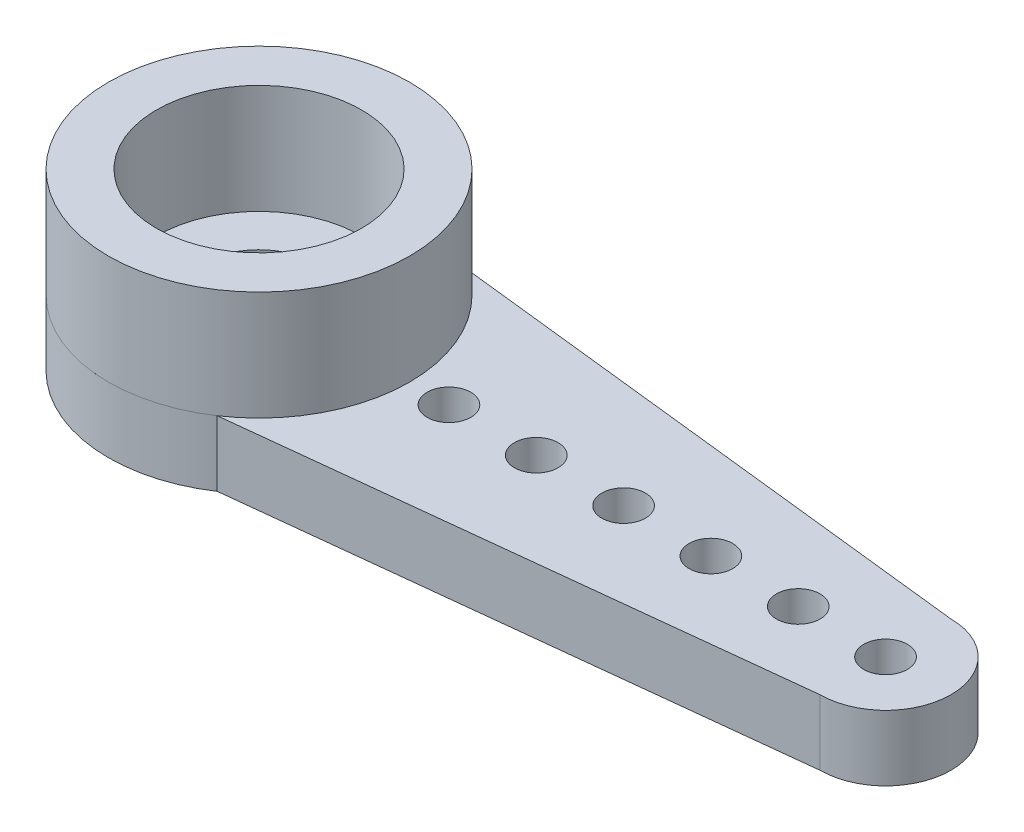
ISO-10303-21;
HEADER;
FILE_DESCRIPTION(('STEP AP214'),'2;1');
FILE_NAME('part.step','',(''),(''),'','','');
FILE_SCHEMA(('AUTOMOTIVE_DESIGN { 1 0 10303 214 1 1 1 1 }'));
ENDSEC;
DATA;
#1=APPLICATION_CONTEXT('core data for automotive mechanical design processes');
#2=APPLICATION_PROTOCOL_DEFINITION('international standard','automotive_design',2000,#1);
#3=PRODUCT_CONTEXT('',#1,'mechanical');
#4=PRODUCT('Part','Part','',(#3));
#5=PRODUCT_RELATED_PRODUCT_CATEGORY('part','',(#4));
#6=PRODUCT_DEFINITION_FORMATION('','',#4);
#7=PRODUCT_DEFINITION_CONTEXT('part definition',#1,'design');
#8=PRODUCT_DEFINITION('design','',#6,#7);
#9=PRODUCT_DEFINITION_SHAPE('','',#8);
#10=(LENGTH_UNIT() NAMED_UNIT(*) SI_UNIT(.MILLI.,.METRE.));
#11=(NAMED_UNIT(*) PLANE_ANGLE_UNIT() SI_UNIT($,.RADIAN.));
#12=(NAMED_UNIT(*) SI_UNIT($,.STERADIAN.) SOLID_ANGLE_UNIT());
#13=UNCERTAINTY_MEASURE_WITH_UNIT(LENGTH_MEASURE(1.E-05),#10,'distance_accuracy_value','');
#14=(GEOMETRIC_REPRESENTATION_CONTEXT(3) GLOBAL_UNCERTAINTY_ASSIGNED_CONTEXT((#13)) GLOBAL_UNIT_ASSIGNED_CONTEXT((#10,
#11,#12)) REPRESENTATION_CONTEXT('',''));
#15=CARTESIAN_POINT('',(0.,0.,0.));
#16=DIRECTION('',(0.,0.,1.));
#17=DIRECTION('',(1.,0.,0.));
#18=AXIS2_PLACEMENT_3D('',#15,#16,#17);
#19=CARTESIAN_POINT('',(0.,4.,0.));
#20=DIRECTION('',(0.,-1.,0.));
#21=DIRECTION('',(0.,0.,-1.));
#22=AXIS2_PLACEMENT_3D('',#19,#20,#21);
#23=CYLINDRICAL_SURFACE('',#22,2.35);
#24=CARTESIAN_POINT('',(0.,4.,0.));
#25=DIRECTION('',(0.,1.,0.));
#26=DIRECTION('',(0.,0.,1.));
#27=AXIS2_PLACEMENT_3D('',#24,#25,#26);
#28=CIRCLE('',#27,2.35);
#29=CARTESIAN_POINT('',(0.,4.,2.35));
#30=VERTEX_POINT('',#29);
#31=EDGE_CURVE('E48',#30,#30,#28,.T.);
#32=ORIENTED_EDGE('',*,*,#31,.T.);
#33=EDGE_LOOP('',(#32));
#34=FACE_BOUND('',#33,.T.);
#35=CARTESIAN_POINT('',(0.,1.5,0.));
#36=DIRECTION('',(0.,1.,0.));
#37=DIRECTION('',(0.,0.,1.));
#38=AXIS2_PLACEMENT_3D('',#35,#36,#37);
#39=CIRCLE('',#38,2.35);
#40=CARTESIAN_POINT('',(0.,1.5,2.35));
#41=VERTEX_POINT('',#40);
#42=EDGE_CURVE('E54',#41,#41,#39,.T.);
#43=ORIENTED_EDGE('',*,*,#42,.F.);
#44=EDGE_LOOP('',(#43));
#45=FACE_BOUND('',#44,.T.);
#46=ADVANCED_FACE('F41',(#34,#45),#23,.F.);
#47=CARTESIAN_POINT('',(0.,4.,0.));
#48=DIRECTION('',(0.,-1.,0.));
#49=DIRECTION('',(0.,0.,-1.));
#50=AXIS2_PLACEMENT_3D('',#47,#48,#49);
#51=CYLINDRICAL_SURFACE('',#50,3.45);
#52=CARTESIAN_POINT('',(0.,4.,0.));
#53=DIRECTION('',(0.,1.,0.));
#54=DIRECTION('',(0.,0.,1.));
#55=AXIS2_PLACEMENT_3D('',#52,#53,#54);
#56=CIRCLE('',#55,3.45);
#57=CARTESIAN_POINT('',(0.,4.,3.45));
#58=VERTEX_POINT('',#57);
#59=EDGE_CURVE('E11',#58,#58,#56,.T.);
#60=ORIENTED_EDGE('',*,*,#59,.F.);
#61=EDGE_LOOP('',(#60));
#62=FACE_BOUND('',#61,.T.);
#63=CARTESIAN_POINT('',(0.,1.5,0.));
#64=DIRECTION('',(0.,1.,0.));
#65=DIRECTION('',(0.,0.,1.));
#66=AXIS2_PLACEMENT_3D('',#63,#64,#65);
#67=CIRCLE('',#66,3.45);
#68=CARTESIAN_POINT('',(0.,1.5,3.45));
#69=VERTEX_POINT('',#68);
#70=EDGE_CURVE('E44',#69,#69,#67,.T.);
#71=ORIENTED_EDGE('',*,*,#70,.T.);
#72=EDGE_LOOP('',(#71));
#73=FACE_BOUND('',#72,.T.);
#74=ADVANCED_FACE('F61',(#62,#73),#51,.T.);
#75=CARTESIAN_POINT('',(0.,4.,0.));
#76=DIRECTION('',(0.,1.,0.));
#77=DIRECTION('',(0.,0.,1.));
#78=AXIS2_PLACEMENT_3D('',#75,#76,#77);
#79=PLANE('',#78);
#80=ORIENTED_EDGE('',*,*,#31,.F.);
#81=EDGE_LOOP('',(#80));
#82=FACE_BOUND('',#81,.T.);
#83=ORIENTED_EDGE('',*,*,#59,.T.);
#84=EDGE_LOOP('',(#83));
#85=FACE_BOUND('',#84,.T.);
#86=ADVANCED_FACE('F65',(#82,#85),#79,.T.);
#87=CARTESIAN_POINT('',(0.,1.5,0.));
#88=DIRECTION('',(0.,1.,0.));
#89=DIRECTION('',(0.,0.,1.));
#90=AXIS2_PLACEMENT_3D('',#87,#88,#89);
#91=PLANE('',#90);
#92=ORIENTED_EDGE('',*,*,#42,.T.);
#93=EDGE_LOOP('',(#92));
#94=FACE_BOUND('',#93,.T.);
#95=ORIENTED_EDGE('',*,*,#70,.F.);
#96=EDGE_LOOP('',(#95));
#97=FACE_BOUND('',#96,.T.);
#98=ADVANCED_FACE('F63',(#94,#97),#91,.F.);
#99=CLOSED_SHELL('',(#46,#74,#86,#98));
#100=MANIFOLD_SOLID_BREP('B2',#99);
#101=CARTESIAN_POINT('',(0.,1.,0.));
#102=DIRECTION('',(0.,1.,0.));
#103=DIRECTION('',(0.,0.,1.));
#104=AXIS2_PLACEMENT_3D('',#101,#102,#103);
#105=CYLINDRICAL_SURFACE('',#104,1.275);
#106=CARTESIAN_POINT('',(0.,1.,0.));
#107=DIRECTION('',(0.,1.,0.));
#108=DIRECTION('',(0.,0.,1.));
#109=AXIS2_PLACEMENT_3D('',#106,#107,#108);
#110=CIRCLE('',#109,1.275);
#111=CARTESIAN_POINT('',(0.,1.,1.275));
#112=VERTEX_POINT('',#111);
#113=EDGE_CURVE('E118',#112,#112,#110,.T.);
#114=ORIENTED_EDGE('',*,*,#113,.F.);
#115=EDGE_LOOP('',(#114));
#116=FACE_BOUND('',#115,.T.);
#117=CARTESIAN_POINT('',(0.,1.5,0.));
#118=DIRECTION('',(0.,1.,0.));
#119=DIRECTION('',(0.,0.,1.));
#120=AXIS2_PLACEMENT_3D('',#117,#118,#119);
#121=CIRCLE('',#120,1.275);
#122=CARTESIAN_POINT('',(0.,1.5,1.275));
#123=VERTEX_POINT('',#122);
#124=EDGE_CURVE('E124',#123,#123,#121,.T.);
#125=ORIENTED_EDGE('',*,*,#124,.T.);
#126=EDGE_LOOP('',(#125));
#127=FACE_BOUND('',#126,.T.);
#128=ADVANCED_FACE('F111',(#116,#127),#105,.F.);
#129=CARTESIAN_POINT('',(0.,1.,0.));
#130=DIRECTION('',(0.,1.,0.));
#131=DIRECTION('',(0.,0.,1.));
#132=AXIS2_PLACEMENT_3D('',#129,#130,#131);
#133=CYLINDRICAL_SURFACE('',#132,2.35);
#134=CARTESIAN_POINT('',(0.,1.,0.));
#135=DIRECTION('',(0.,1.,0.));
#136=DIRECTION('',(0.,0.,1.));
#137=AXIS2_PLACEMENT_3D('',#134,#135,#136);
#138=CIRCLE('',#137,2.35);
#139=CARTESIAN_POINT('',(0.,1.,2.35));
#140=VERTEX_POINT('',#139);
#141=EDGE_CURVE('E40',#140,#140,#138,.T.);
#142=ORIENTED_EDGE('',*,*,#141,.T.);
#143=EDGE_LOOP('',(#142));
#144=FACE_BOUND('',#143,.T.);
#145=CARTESIAN_POINT('',(0.,1.5,0.));
#146=DIRECTION('',(0.,1.,0.));
#147=DIRECTION('',(0.,0.,1.));
#148=AXIS2_PLACEMENT_3D('',#145,#146,#147);
#149=CIRCLE('',#148,2.35);
#150=CARTESIAN_POINT('',(0.,1.5,2.35));
#151=VERTEX_POINT('',#150);
#152=EDGE_CURVE('E114',#151,#151,#149,.T.);
#153=ORIENTED_EDGE('',*,*,#152,.F.);
#154=EDGE_LOOP('',(#153));
#155=FACE_BOUND('',#154,.T.);
#156=ADVANCED_FACE('F133',(#144,#155),#133,.T.);
#157=CARTESIAN_POINT('',(0.,1.,0.));
#158=DIRECTION('',(0.,1.,0.));
#159=DIRECTION('',(0.,0.,1.));
#160=AXIS2_PLACEMENT_3D('',#157,#158,#159);
#161=PLANE('',#160);
#162=ORIENTED_EDGE('',*,*,#113,.T.);
#163=EDGE_LOOP('',(#162));
#164=FACE_BOUND('',#163,.T.);
#165=ORIENTED_EDGE('',*,*,#141,.F.);
#166=EDGE_LOOP('',(#165));
#167=FACE_BOUND('',#166,.T.);
#168=ADVANCED_FACE('F135',(#164,#167),#161,.F.);
#169=CARTESIAN_POINT('',(0.,1.5,0.));
#170=DIRECTION('',(0.,1.,0.));
#171=DIRECTION('',(0.,0.,1.));
#172=AXIS2_PLACEMENT_3D('',#169,#170,#171);
#173=PLANE('',#172);
#174=ORIENTED_EDGE('',*,*,#124,.F.);
#175=EDGE_LOOP('',(#174));
#176=FACE_BOUND('',#175,.T.);
#177=ORIENTED_EDGE('',*,*,#152,.T.);
#178=EDGE_LOOP('',(#177));
#179=FACE_BOUND('',#178,.T.);
#180=ADVANCED_FACE('F131',(#176,#179),#173,.T.);
#181=CLOSED_SHELL('',(#128,#156,#168,#180));
#182=MANIFOLD_SOLID_BREP('B6',#181);
#183=CARTESIAN_POINT('',(14.35,1.5,0.));
#184=DIRECTION('',(0.,1.,0.));
#185=DIRECTION('',(0.,0.,1.));
#186=AXIS2_PLACEMENT_3D('',#183,#184,#185);
#187=PLANE('',#186);
#188=CARTESIAN_POINT('',(6.35,1.5,0.));
#189=DIRECTION('',(0.,1.,0.));
#190=DIRECTION('',(0.,0.,1.));
#191=AXIS2_PLACEMENT_3D('',#188,#189,#190);
#192=CIRCLE('',#191,0.5);
#193=CARTESIAN_POINT('',(6.35,1.5,0.5));
#194=VERTEX_POINT('',#193);
#195=EDGE_CURVE('E278',#194,#194,#192,.T.);
#196=ORIENTED_EDGE('',*,*,#195,.F.);
#197=EDGE_LOOP('',(#196));
#198=FACE_BOUND('',#197,.T.);
#199=CARTESIAN_POINT('',(8.35,1.5,0.));
#200=DIRECTION('',(0.,1.,0.));
#201=DIRECTION('',(0.,0.,1.));
#202=AXIS2_PLACEMENT_3D('',#199,#200,#201);
#203=CIRCLE('',#202,0.500000000000001);
#204=CARTESIAN_POINT('',(8.35,1.5,0.500000000000001));
#205=VERTEX_POINT('',#204);
#206=EDGE_CURVE('E266',#205,#205,#203,.T.);
#207=ORIENTED_EDGE('',*,*,#206,.F.);
#208=EDGE_LOOP('',(#207));
#209=FACE_BOUND('',#208,.T.);
#210=CARTESIAN_POINT('',(12.35,1.5,0.));
#211=DIRECTION('',(0.,1.,0.));
#212=DIRECTION('',(0.,0.,1.));
#213=AXIS2_PLACEMENT_3D('',#210,#211,#212);
#214=CIRCLE('',#213,0.500000000000001);
#215=CARTESIAN_POINT('',(12.35,1.5,0.500000000000001));
#216=VERTEX_POINT('',#215);
#217=EDGE_CURVE('E254',#216,#216,#214,.T.);
#218=ORIENTED_EDGE('',*,*,#217,.F.);
#219=EDGE_LOOP('',(#218));
#220=FACE_BOUND('',#219,.T.);
#221=CARTESIAN_POINT('',(14.35,1.5,0.));
#222=DIRECTION('',(0.,1.,0.));
#223=DIRECTION('',(0.,0.,1.));
#224=AXIS2_PLACEMENT_3D('',#221,#222,#223);
#225=CIRCLE('',#224,1.5);
#226=CARTESIAN_POINT('',(14.35,1.5,1.5));
#227=VERTEX_POINT('',#226);
#228=CARTESIAN_POINT('',(14.35,1.5,-1.5));
#229=VERTEX_POINT('',#228);
#230=EDGE_CURVE('E224',#227,#229,#225,.T.);
#231=ORIENTED_EDGE('',*,*,#230,.T.);
#232=DIRECTION('',(-0.993819276776604,0.,-0.111010112634965));
#233=VECTOR('',#232,1.);
#234=CARTESIAN_POINT('',(14.35,1.5,-1.5));
#235=LINE('',#234,#233);
#236=CARTESIAN_POINT('',(1.87974276835085,1.5,-2.89293399939105));
#237=VERTEX_POINT('',#236);
#238=EDGE_CURVE('E219',#229,#237,#235,.T.);
#239=ORIENTED_EDGE('',*,*,#238,.T.);
#240=CARTESIAN_POINT('',(0.,1.5,0.));
#241=DIRECTION('',(0.,1.,0.));
#242=DIRECTION('',(0.,0.,1.));
#243=AXIS2_PLACEMENT_3D('',#240,#241,#242);
#244=CIRCLE('',#243,3.45);
#245=CARTESIAN_POINT('',(1.913197247407,1.5,2.87091906756604));
#246=VERTEX_POINT('',#245);
#247=EDGE_CURVE('E222',#237,#246,#244,.T.);
#248=ORIENTED_EDGE('',*,*,#247,.T.);
#249=DIRECTION('',(0.993979393584622,0.,-0.109567171767582));
#250=VECTOR('',#249,1.);
#251=CARTESIAN_POINT('',(1.913197247407,1.5,2.87091906756604));
#252=LINE('',#251,#250);
#253=EDGE_CURVE('E189',#246,#227,#252,.T.);
#254=ORIENTED_EDGE('',*,*,#253,.T.);
#255=EDGE_LOOP('',(#231,#239,#248,#254));
#256=FACE_BOUND('',#255,.T.);
#257=CARTESIAN_POINT('',(0.,1.5,0.));
#258=DIRECTION('',(0.,1.,0.));
#259=DIRECTION('',(0.,0.,1.));
#260=AXIS2_PLACEMENT_3D('',#257,#258,#259);
#261=CIRCLE('',#260,2.35);
#262=CARTESIAN_POINT('',(0.,1.5,2.35));
#263=VERTEX_POINT('',#262);
#264=EDGE_CURVE('E239',#263,#263,#261,.T.);
#265=ORIENTED_EDGE('',*,*,#264,.F.);
#266=EDGE_LOOP('',(#265));
#267=FACE_BOUND('',#266,.T.);
#268=CARTESIAN_POINT('',(10.35,1.5,0.));
#269=DIRECTION('',(0.,1.,0.));
#270=DIRECTION('',(0.,0.,1.));
#271=AXIS2_PLACEMENT_3D('',#268,#269,#270);
#272=CIRCLE('',#271,0.500000000000001);
#273=CARTESIAN_POINT('',(10.35,1.5,0.500000000000001));
#274=VERTEX_POINT('',#273);
#275=EDGE_CURVE('E260',#274,#274,#272,.T.);
#276=ORIENTED_EDGE('',*,*,#275,.F.);
#277=EDGE_LOOP('',(#276));
#278=FACE_BOUND('',#277,.T.);
#279=CARTESIAN_POINT('',(14.35,1.5,0.));
#280=DIRECTION('',(0.,1.,0.));
#281=DIRECTION('',(0.,0.,1.));
#282=AXIS2_PLACEMENT_3D('',#279,#280,#281);
#283=CIRCLE('',#282,0.499999999999999);
#284=CARTESIAN_POINT('',(14.35,1.5,0.499999999999999));
#285=VERTEX_POINT('',#284);
#286=EDGE_CURVE('E272',#285,#285,#283,.T.);
#287=ORIENTED_EDGE('',*,*,#286,.F.);
#288=EDGE_LOOP('',(#287));
#289=FACE_BOUND('',#288,.T.);
#290=CARTESIAN_POINT('',(4.35,1.5,0.));
#291=DIRECTION('',(0.,1.,0.));
#292=DIRECTION('',(0.,0.,1.));
#293=AXIS2_PLACEMENT_3D('',#290,#291,#292);
#294=CIRCLE('',#293,0.500000000000001);
#295=CARTESIAN_POINT('',(4.35,1.5,0.500000000000001));
#296=VERTEX_POINT('',#295);
#297=EDGE_CURVE('E284',#296,#296,#294,.T.);
#298=ORIENTED_EDGE('',*,*,#297,.F.);
#299=EDGE_LOOP('',(#298));
#300=FACE_BOUND('',#299,.T.);
#301=ADVANCED_FACE('F172',(#198,#209,#220,#256,#267,#278,#289,#300),#187,.T.);
#302=CARTESIAN_POINT('',(14.35,0.,0.));
#303=DIRECTION('',(0.,1.,0.));
#304=DIRECTION('',(0.,0.,1.));
#305=AXIS2_PLACEMENT_3D('',#302,#303,#304);
#306=PLANE('',#305);
#307=CARTESIAN_POINT('',(14.35,0.,0.));
#308=DIRECTION('',(0.,1.,0.));
#309=DIRECTION('',(0.,0.,1.));
#310=AXIS2_PLACEMENT_3D('',#307,#308,#309);
#311=CIRCLE('',#310,1.5);
#312=CARTESIAN_POINT('',(14.35,0.,1.5));
#313=VERTEX_POINT('',#312);
#314=CARTESIAN_POINT('',(14.35,0.,-1.5));
#315=VERTEX_POINT('',#314);
#316=EDGE_CURVE('E236',#313,#315,#311,.T.);
#317=ORIENTED_EDGE('',*,*,#316,.F.);
#318=DIRECTION('',(0.993979393584622,0.,-0.109567171767582));
#319=VECTOR('',#318,1.);
#320=CARTESIAN_POINT('',(1.913197247407,0.,2.87091906756604));
#321=LINE('',#320,#319);
#322=CARTESIAN_POINT('',(1.913197247407,0.,2.87091906756604));
#323=VERTEX_POINT('',#322);
#324=EDGE_CURVE('E212',#323,#313,#321,.T.);
#325=ORIENTED_EDGE('',*,*,#324,.F.);
#326=CARTESIAN_POINT('',(0.,0.,0.));
#327=DIRECTION('',(0.,1.,0.));
#328=DIRECTION('',(0.,0.,1.));
#329=AXIS2_PLACEMENT_3D('',#326,#327,#328);
#330=CIRCLE('',#329,3.45);
#331=CARTESIAN_POINT('',(1.87974276835085,0.,-2.89293399939105));
#332=VERTEX_POINT('',#331);
#333=EDGE_CURVE('E206',#332,#323,#330,.T.);
#334=ORIENTED_EDGE('',*,*,#333,.F.);
#335=DIRECTION('',(-0.993819276776604,0.,-0.111010112634965));
#336=VECTOR('',#335,1.);
#337=CARTESIAN_POINT('',(14.35,0.,-1.5));
#338=LINE('',#337,#336);
#339=EDGE_CURVE('E228',#315,#332,#338,.T.);
#340=ORIENTED_EDGE('',*,*,#339,.F.);
#341=EDGE_LOOP('',(#317,#325,#334,#340));
#342=FACE_BOUND('',#341,.T.);
#343=CARTESIAN_POINT('',(0.,0.,0.));
#344=DIRECTION('',(0.,1.,0.));
#345=DIRECTION('',(0.,0.,1.));
#346=AXIS2_PLACEMENT_3D('',#343,#344,#345);
#347=CIRCLE('',#346,2.35);
#348=CARTESIAN_POINT('',(0.,0.,2.35));
#349=VERTEX_POINT('',#348);
#350=EDGE_CURVE('E251',#349,#349,#347,.T.);
#351=ORIENTED_EDGE('',*,*,#350,.T.);
#352=EDGE_LOOP('',(#351));
#353=FACE_BOUND('',#352,.T.);
#354=CARTESIAN_POINT('',(12.35,0.,0.));
#355=DIRECTION('',(0.,1.,0.));
#356=DIRECTION('',(0.,0.,1.));
#357=AXIS2_PLACEMENT_3D('',#354,#355,#356);
#358=CIRCLE('',#357,0.500000000000001);
#359=CARTESIAN_POINT('',(12.35,0.,0.500000000000001));
#360=VERTEX_POINT('',#359);
#361=EDGE_CURVE('E257',#360,#360,#358,.T.);
#362=ORIENTED_EDGE('',*,*,#361,.T.);
#363=EDGE_LOOP('',(#362));
#364=FACE_BOUND('',#363,.T.);
#365=CARTESIAN_POINT('',(10.35,0.,0.));
#366=DIRECTION('',(0.,1.,0.));
#367=DIRECTION('',(0.,0.,1.));
#368=AXIS2_PLACEMENT_3D('',#365,#366,#367);
#369=CIRCLE('',#368,0.500000000000001);
#370=CARTESIAN_POINT('',(10.35,0.,0.500000000000001));
#371=VERTEX_POINT('',#370);
#372=EDGE_CURVE('E263',#371,#371,#369,.T.);
#373=ORIENTED_EDGE('',*,*,#372,.T.);
#374=EDGE_LOOP('',(#373));
#375=FACE_BOUND('',#374,.T.);
#376=CARTESIAN_POINT('',(8.35,0.,0.));
#377=DIRECTION('',(0.,1.,0.));
#378=DIRECTION('',(0.,0.,1.));
#379=AXIS2_PLACEMENT_3D('',#376,#377,#378);
#380=CIRCLE('',#379,0.500000000000001);
#381=CARTESIAN_POINT('',(8.35,0.,0.500000000000001));
#382=VERTEX_POINT('',#381);
#383=EDGE_CURVE('E269',#382,#382,#380,.T.);
#384=ORIENTED_EDGE('',*,*,#383,.T.);
#385=EDGE_LOOP('',(#384));
#386=FACE_BOUND('',#385,.T.);
#387=CARTESIAN_POINT('',(14.35,0.,0.));
#388=DIRECTION('',(0.,1.,0.));
#389=DIRECTION('',(0.,0.,1.));
#390=AXIS2_PLACEMENT_3D('',#387,#388,#389);
#391=CIRCLE('',#390,0.499999999999999);
#392=CARTESIAN_POINT('',(14.35,0.,0.499999999999999));
#393=VERTEX_POINT('',#392);
#394=EDGE_CURVE('E275',#393,#393,#391,.T.);
#395=ORIENTED_EDGE('',*,*,#394,.T.);
#396=EDGE_LOOP('',(#395));
#397=FACE_BOUND('',#396,.T.);
#398=CARTESIAN_POINT('',(6.35,0.,0.));
#399=DIRECTION('',(0.,1.,0.));
#400=DIRECTION('',(0.,0.,1.));
#401=AXIS2_PLACEMENT_3D('',#398,#399,#400);
#402=CIRCLE('',#401,0.5);
#403=CARTESIAN_POINT('',(6.35,0.,0.5));
#404=VERTEX_POINT('',#403);
#405=EDGE_CURVE('E281',#404,#404,#402,.T.);
#406=ORIENTED_EDGE('',*,*,#405,.T.);
#407=EDGE_LOOP('',(#406));
#408=FACE_BOUND('',#407,.T.);
#409=CARTESIAN_POINT('',(4.35,0.,0.));
#410=DIRECTION('',(0.,1.,0.));
#411=DIRECTION('',(0.,0.,1.));
#412=AXIS2_PLACEMENT_3D('',#409,#410,#411);
#413=CIRCLE('',#412,0.500000000000001);
#414=CARTESIAN_POINT('',(4.35,0.,0.500000000000001));
#415=VERTEX_POINT('',#414);
#416=EDGE_CURVE('E287',#415,#415,#413,.T.);
#417=ORIENTED_EDGE('',*,*,#416,.T.);
#418=EDGE_LOOP('',(#417));
#419=FACE_BOUND('',#418,.T.);
#420=ADVANCED_FACE('F247',(#342,#353,#364,#375,#386,#397,#408,#419),#306,.F.);
#421=CARTESIAN_POINT('',(14.35,1.5,0.));
#422=DIRECTION('',(0.,-1.,0.));
#423=DIRECTION('',(0.,0.,-1.));
#424=AXIS2_PLACEMENT_3D('',#421,#422,#423);
#425=CYLINDRICAL_SURFACE('',#424,1.5);
#426=ORIENTED_EDGE('',*,*,#316,.T.);
#427=DIRECTION('',(0.,-1.,0.));
#428=VECTOR('',#427,1.);
#429=CARTESIAN_POINT('',(14.35,1.5,-1.5));
#430=LINE('',#429,#428);
#431=EDGE_CURVE('E109',#229,#315,#430,.T.);
#432=ORIENTED_EDGE('',*,*,#431,.F.);
#433=ORIENTED_EDGE('',*,*,#230,.F.);
#434=DIRECTION('',(0.,-1.,0.));
#435=VECTOR('',#434,1.);
#436=CARTESIAN_POINT('',(14.35,1.5,1.5));
#437=LINE('',#436,#435);
#438=EDGE_CURVE('E232',#227,#313,#437,.T.);
#439=ORIENTED_EDGE('',*,*,#438,.T.);
#440=EDGE_LOOP('',(#426,#432,#433,#439));
#441=FACE_BOUND('',#440,.T.);
#442=ADVANCED_FACE('F174',(#441),#425,.T.);
#443=CARTESIAN_POINT('',(14.35,1.5,-1.5));
#444=DIRECTION('',(-0.111010112634965,0.,0.993819276776604));
#445=DIRECTION('',(0.993819276776604,0.,0.111010112634965));
#446=AXIS2_PLACEMENT_3D('',#443,#444,#445);
#447=PLANE('',#446);
#448=ORIENTED_EDGE('',*,*,#339,.T.);
#449=DIRECTION('',(0.,-1.,0.));
#450=VECTOR('',#449,1.);
#451=CARTESIAN_POINT('',(1.87974276835085,1.5,-2.89293399939105));
#452=LINE('',#451,#450);
#453=EDGE_CURVE('E181',#237,#332,#452,.T.);
#454=ORIENTED_EDGE('',*,*,#453,.F.);
#455=ORIENTED_EDGE('',*,*,#238,.F.);
#456=ORIENTED_EDGE('',*,*,#431,.T.);
#457=EDGE_LOOP('',(#448,#454,#455,#456));
#458=FACE_BOUND('',#457,.T.);
#459=ADVANCED_FACE('F227',(#458),#447,.F.);
#460=CARTESIAN_POINT('',(0.,1.5,0.));
#461=DIRECTION('',(0.,-1.,0.));
#462=DIRECTION('',(0.,0.,-1.));
#463=AXIS2_PLACEMENT_3D('',#460,#461,#462);
#464=CYLINDRICAL_SURFACE('',#463,3.45);
#465=ORIENTED_EDGE('',*,*,#333,.T.);
#466=DIRECTION('',(0.,-1.,0.));
#467=VECTOR('',#466,1.);
#468=CARTESIAN_POINT('',(1.913197247407,1.5,2.87091906756604));
#469=LINE('',#468,#467);
#470=EDGE_CURVE('E229',#246,#323,#469,.T.);
#471=ORIENTED_EDGE('',*,*,#470,.F.);
#472=ORIENTED_EDGE('',*,*,#247,.F.);
#473=ORIENTED_EDGE('',*,*,#453,.T.);
#474=EDGE_LOOP('',(#465,#471,#472,#473));
#475=FACE_BOUND('',#474,.T.);
#476=ADVANCED_FACE('F230',(#475),#464,.T.);
#477=CARTESIAN_POINT('',(1.913197247407,1.5,2.87091906756604));
#478=DIRECTION('',(-0.109567171767582,0.,-0.993979393584622));
#479=DIRECTION('',(-0.993979393584622,0.,0.109567171767582));
#480=AXIS2_PLACEMENT_3D('',#477,#478,#479);
#481=PLANE('',#480);
#482=ORIENTED_EDGE('',*,*,#324,.T.);
#483=ORIENTED_EDGE('',*,*,#438,.F.);
#484=ORIENTED_EDGE('',*,*,#253,.F.);
#485=ORIENTED_EDGE('',*,*,#470,.T.);
#486=EDGE_LOOP('',(#482,#483,#484,#485));
#487=FACE_BOUND('',#486,.T.);
#488=ADVANCED_FACE('F244',(#487),#481,.F.);
#489=CARTESIAN_POINT('',(0.,1.5,0.));
#490=DIRECTION('',(0.,-1.,0.));
#491=DIRECTION('',(0.,0.,-1.));
#492=AXIS2_PLACEMENT_3D('',#489,#490,#491);
#493=CYLINDRICAL_SURFACE('',#492,2.35);
#494=ORIENTED_EDGE('',*,*,#264,.T.);
#495=EDGE_LOOP('',(#494));
#496=FACE_BOUND('',#495,.T.);
#497=ORIENTED_EDGE('',*,*,#350,.F.);
#498=EDGE_LOOP('',(#497));
#499=FACE_BOUND('',#498,.T.);
#500=ADVANCED_FACE('F306',(#496,#499),#493,.F.);
#501=CARTESIAN_POINT('',(12.35,1.5,0.));
#502=DIRECTION('',(0.,-1.,0.));
#503=DIRECTION('',(0.,0.,-1.));
#504=AXIS2_PLACEMENT_3D('',#501,#502,#503);
#505=CYLINDRICAL_SURFACE('',#504,0.500000000000001);
#506=ORIENTED_EDGE('',*,*,#217,.T.);
#507=EDGE_LOOP('',(#506));
#508=FACE_BOUND('',#507,.T.);
#509=ORIENTED_EDGE('',*,*,#361,.F.);
#510=EDGE_LOOP('',(#509));
#511=FACE_BOUND('',#510,.T.);
#512=ADVANCED_FACE('F352',(#508,#511),#505,.F.);
#513=CARTESIAN_POINT('',(10.35,1.5,0.));
#514=DIRECTION('',(0.,-1.,0.));
#515=DIRECTION('',(0.,0.,-1.));
#516=AXIS2_PLACEMENT_3D('',#513,#514,#515);
#517=CYLINDRICAL_SURFACE('',#516,0.500000000000001);
#518=ORIENTED_EDGE('',*,*,#275,.T.);
#519=EDGE_LOOP('',(#518));
#520=FACE_BOUND('',#519,.T.);
#521=ORIENTED_EDGE('',*,*,#372,.F.);
#522=EDGE_LOOP('',(#521));
#523=FACE_BOUND('',#522,.T.);
#524=ADVANCED_FACE('F360',(#520,#523),#517,.F.);
#525=CARTESIAN_POINT('',(8.35,1.5,0.));
#526=DIRECTION('',(0.,-1.,0.));
#527=DIRECTION('',(0.,0.,-1.));
#528=AXIS2_PLACEMENT_3D('',#525,#526,#527);
#529=CYLINDRICAL_SURFACE('',#528,0.500000000000001);
#530=ORIENTED_EDGE('',*,*,#206,.T.);
#531=EDGE_LOOP('',(#530));
#532=FACE_BOUND('',#531,.T.);
#533=ORIENTED_EDGE('',*,*,#383,.F.);
#534=EDGE_LOOP('',(#533));
#535=FACE_BOUND('',#534,.T.);
#536=ADVANCED_FACE('F368',(#532,#535),#529,.F.);
#537=CARTESIAN_POINT('',(14.35,1.5,0.));
#538=DIRECTION('',(0.,-1.,0.));
#539=DIRECTION('',(0.,0.,-1.));
#540=AXIS2_PLACEMENT_3D('',#537,#538,#539);
#541=CYLINDRICAL_SURFACE('',#540,0.499999999999999);
#542=ORIENTED_EDGE('',*,*,#286,.T.);
#543=EDGE_LOOP('',(#542));
#544=FACE_BOUND('',#543,.T.);
#545=ORIENTED_EDGE('',*,*,#394,.F.);
#546=EDGE_LOOP('',(#545));
#547=FACE_BOUND('',#546,.T.);
#548=ADVANCED_FACE('F377',(#544,#547),#541,.F.);
#549=CARTESIAN_POINT('',(6.35,1.5,0.));
#550=DIRECTION('',(0.,-1.,0.));
#551=DIRECTION('',(0.,0.,-1.));
#552=AXIS2_PLACEMENT_3D('',#549,#550,#551);
#553=CYLINDRICAL_SURFACE('',#552,0.5);
#554=ORIENTED_EDGE('',*,*,#195,.T.);
#555=EDGE_LOOP('',(#554));
#556=FACE_BOUND('',#555,.T.);
#557=ORIENTED_EDGE('',*,*,#405,.F.);
#558=EDGE_LOOP('',(#557));
#559=FACE_BOUND('',#558,.T.);
#560=ADVANCED_FACE('F386',(#556,#559),#553,.F.);
#561=CARTESIAN_POINT('',(4.35,1.5,0.));
#562=DIRECTION('',(0.,-1.,0.));
#563=DIRECTION('',(0.,0.,-1.));
#564=AXIS2_PLACEMENT_3D('',#561,#562,#563);
#565=CYLINDRICAL_SURFACE('',#564,0.500000000000001);
#566=ORIENTED_EDGE('',*,*,#297,.T.);
#567=EDGE_LOOP('',(#566));
#568=FACE_BOUND('',#567,.T.);
#569=ORIENTED_EDGE('',*,*,#416,.F.);
#570=EDGE_LOOP('',(#569));
#571=FACE_BOUND('',#570,.T.);
#572=ADVANCED_FACE('F293',(#568,#571),#565,.F.);
#573=CLOSED_SHELL('',(#301,#420,#442,#459,#476,#488,#500,#512,#524,#536,#548,#560,#572));
#574=MANIFOLD_SOLID_BREP('B35',#573);
#575=ADVANCED_BREP_SHAPE_REPRESENTATION('',(#18,#100,#182,#574),#14);
#576=SHAPE_DEFINITION_REPRESENTATION(#9,#575);
ENDSEC;
END-ISO-10303-21;
